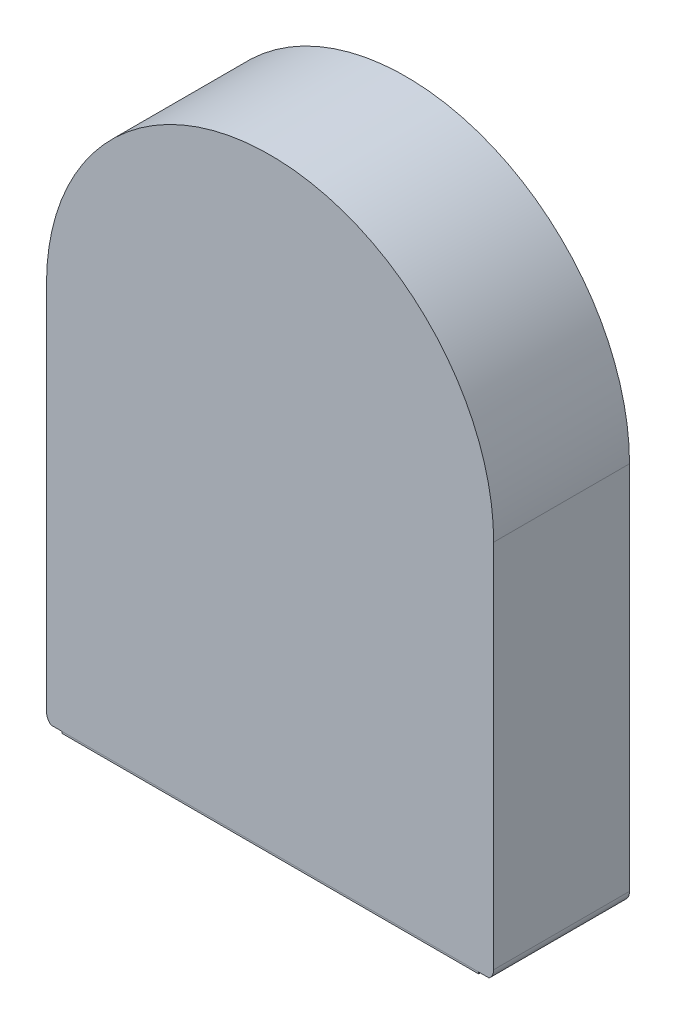
ISO-10303-21;
HEADER;
FILE_DESCRIPTION(('STEP AP214'),'2;1');
FILE_NAME('part.step','',(''),(''),'','','');
FILE_SCHEMA(('AUTOMOTIVE_DESIGN { 1 0 10303 214 1 1 1 1 }'));
ENDSEC;
DATA;
#1=APPLICATION_CONTEXT('core data for automotive mechanical design processes');
#2=APPLICATION_PROTOCOL_DEFINITION('international standard','automotive_design',2000,#1);
#3=PRODUCT_CONTEXT('',#1,'mechanical');
#4=PRODUCT('Part','Part','',(#3));
#5=PRODUCT_RELATED_PRODUCT_CATEGORY('part','',(#4));
#6=PRODUCT_DEFINITION_FORMATION('','',#4);
#7=PRODUCT_DEFINITION_CONTEXT('part definition',#1,'design');
#8=PRODUCT_DEFINITION('design','',#6,#7);
#9=PRODUCT_DEFINITION_SHAPE('','',#8);
#10=(LENGTH_UNIT() NAMED_UNIT(*) SI_UNIT(.MILLI.,.METRE.));
#11=(NAMED_UNIT(*) PLANE_ANGLE_UNIT() SI_UNIT($,.RADIAN.));
#12=(NAMED_UNIT(*) SI_UNIT($,.STERADIAN.) SOLID_ANGLE_UNIT());
#13=UNCERTAINTY_MEASURE_WITH_UNIT(LENGTH_MEASURE(1.E-05),#10,'distance_accuracy_value','');
#14=(GEOMETRIC_REPRESENTATION_CONTEXT(3) GLOBAL_UNCERTAINTY_ASSIGNED_CONTEXT((#13)) GLOBAL_UNIT_ASSIGNED_CONTEXT((#10,
#11,#12)) REPRESENTATION_CONTEXT('',''));
#15=CARTESIAN_POINT('',(0.,0.,0.));
#16=DIRECTION('',(0.,0.,1.));
#17=DIRECTION('',(1.,0.,0.));
#18=AXIS2_PLACEMENT_3D('',#15,#16,#17);
#19=CARTESIAN_POINT('',(8.8,-15.4,5.65));
#20=DIRECTION('',(0.,0.,-1.));
#21=DIRECTION('',(-1.,0.,0.));
#22=AXIS2_PLACEMENT_3D('',#19,#20,#21);
#23=CYLINDRICAL_SURFACE('',#22,0.5);
#24=CARTESIAN_POINT('',(8.8,-15.4,6.03039935251033));
#25=DIRECTION('',(0.,0.713250449154018,-0.700909264300018));
#26=DIRECTION('',(0.,0.700909264300018,0.713250449154018));
#27=AXIS2_PLACEMENT_3D('',#24,#25,#26);
#28=ELLIPSE('',#27,0.713359097199747,0.5);
#29=CARTESIAN_POINT('',(9.10934525688194,-15.79281740293,5.63066545920087));
#30=VERTEX_POINT('',#29);
#31=CARTESIAN_POINT('',(8.8,-15.9,5.52159565602451));
#32=VERTEX_POINT('',#31);
#33=EDGE_CURVE('E55',#30,#32,#28,.T.);
#34=ORIENTED_EDGE('',*,*,#33,.T.);
#35=DIRECTION('',(0.,0.,-1.));
#36=VECTOR('',#35,1.);
#37=CARTESIAN_POINT('',(8.8,-15.9,5.65));
#38=LINE('',#37,#36);
#39=CARTESIAN_POINT('',(8.8,-15.9,0.));
#40=VERTEX_POINT('',#39);
#41=EDGE_CURVE('E257',#40,#32,#38,.F.);
#42=ORIENTED_EDGE('',*,*,#41,.F.);
#43=CARTESIAN_POINT('',(8.8,-15.4,0.));
#44=DIRECTION('',(0.,0.,1.));
#45=DIRECTION('',(1.,0.,0.));
#46=AXIS2_PLACEMENT_3D('',#43,#44,#45);
#47=CIRCLE('',#46,0.5);
#48=CARTESIAN_POINT('',(9.3,-15.4,0.));
#49=VERTEX_POINT('',#48);
#50=EDGE_CURVE('E261',#49,#40,#47,.F.);
#51=ORIENTED_EDGE('',*,*,#50,.F.);
#52=DIRECTION('',(0.,0.,-1.));
#53=VECTOR('',#52,1.);
#54=CARTESIAN_POINT('',(9.3,-15.4,5.65));
#55=LINE('',#54,#53);
#56=CARTESIAN_POINT('',(9.3,-15.4,5.65));
#57=VERTEX_POINT('',#56);
#58=EDGE_CURVE('E265',#57,#49,#55,.T.);
#59=ORIENTED_EDGE('',*,*,#58,.F.);
#60=CARTESIAN_POINT('',(8.8,-15.4,5.65));
#61=DIRECTION('',(0.,0.,1.));
#62=DIRECTION('',(1.,0.,0.));
#63=AXIS2_PLACEMENT_3D('',#60,#61,#62);
#64=CIRCLE('',#63,0.5);
#65=CARTESIAN_POINT('',(9.10934525688194,-15.79281740293,5.65));
#66=VERTEX_POINT('',#65);
#67=EDGE_CURVE('E252',#66,#57,#64,.T.);
#68=ORIENTED_EDGE('',*,*,#67,.F.);
#69=DIRECTION('',(0.,0.,-1.));
#70=VECTOR('',#69,1.);
#71=CARTESIAN_POINT('',(9.10934525730095,-15.7928174026,5.65));
#72=LINE('',#71,#70);
#73=EDGE_CURVE('E48',#30,#66,#72,.F.);
#74=ORIENTED_EDGE('',*,*,#73,.F.);
#75=EDGE_LOOP('',(#34,#42,#51,#59,#68,#74));
#76=FACE_BOUND('',#75,.T.);
#77=ADVANCED_FACE('F38',(#76),#23,.T.);
#78=CARTESIAN_POINT('',(-8.8,-15.4,5.65));
#79=DIRECTION('',(0.,0.,-1.));
#80=DIRECTION('',(-1.,0.,0.));
#81=AXIS2_PLACEMENT_3D('',#78,#79,#80);
#82=CYLINDRICAL_SURFACE('',#81,0.5);
#83=CARTESIAN_POINT('',(-8.8,-15.4,5.65));
#84=DIRECTION('',(0.,0.,1.));
#85=DIRECTION('',(1.,0.,0.));
#86=AXIS2_PLACEMENT_3D('',#83,#84,#85);
#87=CIRCLE('',#86,0.5);
#88=CARTESIAN_POINT('',(-9.3,-15.4,5.65));
#89=VERTEX_POINT('',#88);
#90=CARTESIAN_POINT('',(-9.10934525730095,-15.7928174026,5.65));
#91=VERTEX_POINT('',#90);
#92=EDGE_CURVE('E254',#89,#91,#87,.T.);
#93=ORIENTED_EDGE('',*,*,#92,.F.);
#94=DIRECTION('',(0.,0.,-1.));
#95=VECTOR('',#94,1.);
#96=CARTESIAN_POINT('',(-9.3,-15.4,5.65));
#97=LINE('',#96,#95);
#98=CARTESIAN_POINT('',(-9.3,-15.4,0.));
#99=VERTEX_POINT('',#98);
#100=EDGE_CURVE('E250',#99,#89,#97,.F.);
#101=ORIENTED_EDGE('',*,*,#100,.F.);
#102=CARTESIAN_POINT('',(-8.8,-15.4,0.));
#103=DIRECTION('',(0.,0.,1.));
#104=DIRECTION('',(1.,0.,0.));
#105=AXIS2_PLACEMENT_3D('',#102,#103,#104);
#106=CIRCLE('',#105,0.5);
#107=CARTESIAN_POINT('',(-8.8,-15.9,0.));
#108=VERTEX_POINT('',#107);
#109=EDGE_CURVE('E263',#108,#99,#106,.F.);
#110=ORIENTED_EDGE('',*,*,#109,.F.);
#111=DIRECTION('',(0.,0.,-1.));
#112=VECTOR('',#111,1.);
#113=CARTESIAN_POINT('',(-8.8,-15.9,5.65));
#114=LINE('',#113,#112);
#115=CARTESIAN_POINT('',(-8.8,-15.9,5.52159565602451));
#116=VERTEX_POINT('',#115);
#117=EDGE_CURVE('E259',#116,#108,#114,.T.);
#118=ORIENTED_EDGE('',*,*,#117,.F.);
#119=CARTESIAN_POINT('',(-8.8,-15.4,6.03039935251033));
#120=DIRECTION('',(0.,0.713250449154018,-0.700909264300018));
#121=DIRECTION('',(0.,0.700909264300018,0.713250449154018));
#122=AXIS2_PLACEMENT_3D('',#119,#120,#121);
#123=ELLIPSE('',#122,0.713359097199747,0.5);
#124=CARTESIAN_POINT('',(-9.10934525730095,-15.7928174026,5.63066545953665));
#125=VERTEX_POINT('',#124);
#126=EDGE_CURVE('E145',#116,#125,#123,.T.);
#127=ORIENTED_EDGE('',*,*,#126,.T.);
#128=DIRECTION('',(0.,0.,1.));
#129=VECTOR('',#128,1.);
#130=CARTESIAN_POINT('',(-9.10934525730095,-15.7928174026,5.63066545953665));
#131=LINE('',#130,#129);
#132=EDGE_CURVE('E195',#125,#91,#131,.T.);
#133=ORIENTED_EDGE('',*,*,#132,.T.);
#134=EDGE_LOOP('',(#93,#101,#110,#118,#127,#133));
#135=FACE_BOUND('',#134,.T.);
#136=ADVANCED_FACE('F40',(#135),#82,.T.);
#137=CARTESIAN_POINT('',(0.,0.,5.65));
#138=DIRECTION('',(0.,0.,-1.));
#139=DIRECTION('',(-1.,0.,0.));
#140=AXIS2_PLACEMENT_3D('',#137,#138,#139);
#141=CYLINDRICAL_SURFACE('',#140,9.3);
#142=CARTESIAN_POINT('',(0.,0.,0.));
#143=DIRECTION('',(0.,0.,1.));
#144=DIRECTION('',(1.,0.,0.));
#145=AXIS2_PLACEMENT_3D('',#142,#143,#144);
#146=CIRCLE('',#145,9.3);
#147=CARTESIAN_POINT('',(9.3,0.,0.));
#148=VERTEX_POINT('',#147);
#149=CARTESIAN_POINT('',(-9.3,0.,0.));
#150=VERTEX_POINT('',#149);
#151=EDGE_CURVE('E200',#148,#150,#146,.T.);
#152=ORIENTED_EDGE('',*,*,#151,.T.);
#153=DIRECTION('',(0.,0.,-1.));
#154=VECTOR('',#153,1.);
#155=CARTESIAN_POINT('',(-9.3,0.,5.65));
#156=LINE('',#155,#154);
#157=CARTESIAN_POINT('',(-9.3,0.,5.65));
#158=VERTEX_POINT('',#157);
#159=EDGE_CURVE('E267',#158,#150,#156,.T.);
#160=ORIENTED_EDGE('',*,*,#159,.F.);
#161=CARTESIAN_POINT('',(0.,0.,5.65));
#162=DIRECTION('',(0.,0.,1.));
#163=DIRECTION('',(1.,0.,0.));
#164=AXIS2_PLACEMENT_3D('',#161,#162,#163);
#165=CIRCLE('',#164,9.3);
#166=CARTESIAN_POINT('',(9.3,0.,5.65));
#167=VERTEX_POINT('',#166);
#168=EDGE_CURVE('E244',#167,#158,#165,.T.);
#169=ORIENTED_EDGE('',*,*,#168,.F.);
#170=DIRECTION('',(0.,0.,-1.));
#171=VECTOR('',#170,1.);
#172=CARTESIAN_POINT('',(9.3,0.,5.65));
#173=LINE('',#172,#171);
#174=EDGE_CURVE('E269',#167,#148,#173,.T.);
#175=ORIENTED_EDGE('',*,*,#174,.T.);
#176=EDGE_LOOP('',(#152,#160,#169,#175));
#177=FACE_BOUND('',#176,.T.);
#178=ADVANCED_FACE('F357',(#177),#141,.T.);
#179=CARTESIAN_POINT('',(-9.3,0.,5.65));
#180=DIRECTION('',(1.,0.,0.));
#181=DIRECTION('',(0.,1.,0.));
#182=AXIS2_PLACEMENT_3D('',#179,#180,#181);
#183=PLANE('',#182);
#184=ORIENTED_EDGE('',*,*,#159,.T.);
#185=DIRECTION('',(0.,-1.,0.));
#186=VECTOR('',#185,1.);
#187=CARTESIAN_POINT('',(-9.3,0.,0.));
#188=LINE('',#187,#186);
#189=EDGE_CURVE('E277',#150,#99,#188,.T.);
#190=ORIENTED_EDGE('',*,*,#189,.T.);
#191=ORIENTED_EDGE('',*,*,#100,.T.);
#192=DIRECTION('',(0.,-1.,0.));
#193=VECTOR('',#192,1.);
#194=CARTESIAN_POINT('',(-9.3,0.,5.65));
#195=LINE('',#194,#193);
#196=EDGE_CURVE('E241',#158,#89,#195,.T.);
#197=ORIENTED_EDGE('',*,*,#196,.F.);
#198=EDGE_LOOP('',(#184,#190,#191,#197));
#199=FACE_BOUND('',#198,.T.);
#200=ADVANCED_FACE('F358',(#199),#183,.F.);
#201=CARTESIAN_POINT('',(-9.3,-15.9,5.65));
#202=DIRECTION('',(0.,1.,0.));
#203=DIRECTION('',(0.,0.,1.));
#204=AXIS2_PLACEMENT_3D('',#201,#202,#203);
#205=PLANE('',#204);
#206=ORIENTED_EDGE('',*,*,#41,.T.);
#207=DIRECTION('',(-1.,0.,0.));
#208=VECTOR('',#207,1.);
#209=CARTESIAN_POINT('',(0.,-15.9,5.52159565602451));
#210=LINE('',#209,#208);
#211=EDGE_CURVE('E337',#32,#116,#210,.T.);
#212=ORIENTED_EDGE('',*,*,#211,.T.);
#213=ORIENTED_EDGE('',*,*,#117,.T.);
#214=DIRECTION('',(1.,0.,0.));
#215=VECTOR('',#214,1.);
#216=CARTESIAN_POINT('',(-9.3,-15.9,0.));
#217=LINE('',#216,#215);
#218=EDGE_CURVE('E274',#108,#40,#217,.T.);
#219=ORIENTED_EDGE('',*,*,#218,.T.);
#220=EDGE_LOOP('',(#206,#212,#213,#219));
#221=FACE_BOUND('',#220,.T.);
#222=ADVANCED_FACE('F343',(#221),#205,.F.);
#223=CARTESIAN_POINT('',(9.3,0.,5.65));
#224=DIRECTION('',(-1.,0.,0.));
#225=DIRECTION('',(0.,-1.,0.));
#226=AXIS2_PLACEMENT_3D('',#223,#224,#225);
#227=PLANE('',#226);
#228=ORIENTED_EDGE('',*,*,#58,.T.);
#229=DIRECTION('',(0.,1.,0.));
#230=VECTOR('',#229,1.);
#231=CARTESIAN_POINT('',(9.3,0.,0.));
#232=LINE('',#231,#230);
#233=EDGE_CURVE('E247',#49,#148,#232,.T.);
#234=ORIENTED_EDGE('',*,*,#233,.T.);
#235=ORIENTED_EDGE('',*,*,#174,.F.);
#236=DIRECTION('',(0.,1.,0.));
#237=VECTOR('',#236,1.);
#238=CARTESIAN_POINT('',(9.3,0.,5.65));
#239=LINE('',#238,#237);
#240=EDGE_CURVE('E271',#57,#167,#239,.T.);
#241=ORIENTED_EDGE('',*,*,#240,.F.);
#242=EDGE_LOOP('',(#228,#234,#235,#241));
#243=FACE_BOUND('',#242,.T.);
#244=ADVANCED_FACE('F354',(#243),#227,.F.);
#245=CARTESIAN_POINT('',(0.,0.,5.65));
#246=DIRECTION('',(0.,0.,1.));
#247=DIRECTION('',(1.,0.,0.));
#248=AXIS2_PLACEMENT_3D('',#245,#246,#247);
#249=PLANE('',#248);
#250=DIRECTION('',(1.,0.,0.));
#251=VECTOR('',#250,1.);
#252=CARTESIAN_POINT('',(-5.00000000075,-15.7926514013,5.64999710245));
#253=LINE('',#252,#251);
#254=CARTESIAN_POINT('',(-6.97971042440521,-15.7927344019421,5.64999855122482));
#255=VERTEX_POINT('',#254);
#256=CARTESIAN_POINT('',(2.97381740255382,-15.7926513759911,5.64999855122139));
#257=VERTEX_POINT('',#256);
#258=EDGE_CURVE('E176',#255,#257,#253,.T.);
#259=ORIENTED_EDGE('',*,*,#258,.T.);
#260=DIRECTION('',(0.999999999999744,1.24820653344968E-08,7.15097058320817E-07));
#261=VECTOR('',#260,1.);
#262=CARTESIAN_POINT('',(4.99999999925,-15.792651376,5.64999855136));
#263=LINE('',#262,#261);
#264=CARTESIAN_POINT('',(6.97971041935568,-15.7927343769389,5.64999998352249));
#265=VERTEX_POINT('',#264);
#266=EDGE_CURVE('E179',#257,#265,#263,.T.);
#267=ORIENTED_EDGE('',*,*,#266,.T.);
#268=DIRECTION('',(-1.,0.,0.));
#269=VECTOR('',#268,1.);
#270=CARTESIAN_POINT('',(0.,-15.7928174026,5.65));
#271=LINE('',#270,#269);
#272=EDGE_CURVE('E198',#66,#265,#271,.T.);
#273=ORIENTED_EDGE('',*,*,#272,.F.);
#274=ORIENTED_EDGE('',*,*,#67,.T.);
#275=ORIENTED_EDGE('',*,*,#240,.T.);
#276=ORIENTED_EDGE('',*,*,#168,.T.);
#277=ORIENTED_EDGE('',*,*,#196,.T.);
#278=ORIENTED_EDGE('',*,*,#92,.T.);
#279=DIRECTION('',(-1.,0.,0.));
#280=VECTOR('',#279,1.);
#281=CARTESIAN_POINT('',(0.,-15.7928174026,5.65));
#282=LINE('',#281,#280);
#283=EDGE_CURVE('E11',#255,#91,#282,.T.);
#284=ORIENTED_EDGE('',*,*,#283,.F.);
#285=EDGE_LOOP('',(#259,#267,#273,#274,#275,#276,#277,#278,#284));
#286=FACE_BOUND('',#285,.T.);
#287=ADVANCED_FACE('F287',(#286),#249,.T.);
#288=CARTESIAN_POINT('',(0.,0.,0.));
#289=DIRECTION('',(0.,0.,1.));
#290=DIRECTION('',(1.,0.,0.));
#291=AXIS2_PLACEMENT_3D('',#288,#289,#290);
#292=PLANE('',#291);
#293=ORIENTED_EDGE('',*,*,#233,.F.);
#294=ORIENTED_EDGE('',*,*,#50,.T.);
#295=ORIENTED_EDGE('',*,*,#218,.F.);
#296=ORIENTED_EDGE('',*,*,#109,.T.);
#297=ORIENTED_EDGE('',*,*,#189,.F.);
#298=ORIENTED_EDGE('',*,*,#151,.F.);
#299=EDGE_LOOP('',(#293,#294,#295,#296,#297,#298));
#300=FACE_BOUND('',#299,.T.);
#301=ADVANCED_FACE('F220',(#300),#292,.F.);
#302=CARTESIAN_POINT('',(-10.,-15.7928174026,7.15));
#303=DIRECTION('',(0.,1.,0.));
#304=DIRECTION('',(0.,0.,1.));
#305=AXIS2_PLACEMENT_3D('',#302,#303,#304);
#306=PLANE('',#305);
#307=ORIENTED_EDGE('',*,*,#272,.T.);
#308=CARTESIAN_POINT('',(6.97975192830906,-15.7928174026,5.64048689252252));
#309=DIRECTION('',(-0.00436264473487639,0.0174522403538263,0.999838180225955));
#310=VECTOR('',#309,1.);
#311=LINE('',#308,#310);
#312=CARTESIAN_POINT('',(6.97975192830905,-15.7928174026,5.64048689252252));
#313=VERTEX_POINT('',#312);
#314=EDGE_CURVE('E187',#313,#265,#311,.T.);
#315=ORIENTED_EDGE('',*,*,#314,.F.);
#316=DIRECTION('',(1.,0.,0.));
#317=VECTOR('',#316,1.);
#318=CARTESIAN_POINT('',(-8.66700053469144,-15.7928174026,5.64048689252252));
#319=LINE('',#318,#317);
#320=CARTESIAN_POINT('',(8.66820089689577,-15.7928174026,5.64048689252252));
#321=VERTEX_POINT('',#320);
#322=EDGE_CURVE('E160',#313,#321,#319,.T.);
#323=ORIENTED_EDGE('',*,*,#322,.T.);
#324=DIRECTION('',(0.,0.,-1.));
#325=VECTOR('',#324,1.);
#326=CARTESIAN_POINT('',(8.66820089689577,-15.7928174026,0.999999999999998));
#327=LINE('',#326,#325);
#328=CARTESIAN_POINT('',(8.66821322781486,-15.7928174036935,5.63066545842397));
#329=VERTEX_POINT('',#328);
#330=EDGE_CURVE('E152',#321,#329,#327,.T.);
#331=ORIENTED_EDGE('',*,*,#330,.T.);
#332=DIRECTION('',(-1.,-1.73074002985439E-09,-1.7612138496918E-09));
#333=VECTOR('',#332,1.);
#334=CARTESIAN_POINT('',(-4.9999999983754,-15.7928174273496,5.6306654343513));
#335=LINE('',#334,#333);
#336=EDGE_CURVE('E136',#30,#329,#335,.T.);
#337=ORIENTED_EDGE('',*,*,#336,.F.);
#338=ORIENTED_EDGE('',*,*,#73,.T.);
#339=EDGE_LOOP('',(#307,#315,#323,#331,#337,#338));
#340=FACE_BOUND('',#339,.T.);
#341=ADVANCED_FACE('F157',(#340),#306,.F.);
#342=CARTESIAN_POINT('',(8.27396970801,-15.8738174032,0.999999999999998));
#343=DIRECTION('',(0.,-1.,0.));
#344=DIRECTION('',(0.,0.,-1.));
#345=AXIS2_PLACEMENT_3D('',#342,#343,#344);
#346=PLANE('',#345);
#347=DIRECTION('',(1.,0.,0.));
#348=VECTOR('',#347,1.);
#349=CARTESIAN_POINT('',(8.27396970801,-15.8738174032,5.54823926009538));
#350=LINE('',#349,#348);
#351=CARTESIAN_POINT('',(-8.66700053469144,-15.8738174032,5.54823926009538));
#352=VERTEX_POINT('',#351);
#353=CARTESIAN_POINT('',(8.66820089689577,-15.8738174032,5.54823926009538));
#354=VERTEX_POINT('',#353);
#355=EDGE_CURVE('E155',#352,#354,#350,.T.);
#356=ORIENTED_EDGE('',*,*,#355,.T.);
#357=DIRECTION('',(0.,0.,-1.));
#358=VECTOR('',#357,1.);
#359=CARTESIAN_POINT('',(8.66820089689577,-15.8738174032,0.999999999999998));
#360=LINE('',#359,#358);
#361=CARTESIAN_POINT('',(8.66820089689577,-15.8738174032,5.64048689252252));
#362=VERTEX_POINT('',#361);
#363=EDGE_CURVE('E153',#362,#354,#360,.T.);
#364=ORIENTED_EDGE('',*,*,#363,.F.);
#365=DIRECTION('',(1.,0.,0.));
#366=VECTOR('',#365,1.);
#367=CARTESIAN_POINT('',(-8.66700053469144,-15.8738174032,5.64048689252252));
#368=LINE('',#367,#366);
#369=CARTESIAN_POINT('',(-8.66700053469144,-15.8738174032,5.64048689252252));
#370=VERTEX_POINT('',#369);
#371=EDGE_CURVE('E162',#370,#362,#368,.T.);
#372=ORIENTED_EDGE('',*,*,#371,.F.);
#373=DIRECTION('',(0.,0.,1.));
#374=VECTOR('',#373,1.);
#375=CARTESIAN_POINT('',(-8.66700053469144,-15.8738174032,0.999999999999998));
#376=LINE('',#375,#374);
#377=EDGE_CURVE('E321',#352,#370,#376,.T.);
#378=ORIENTED_EDGE('',*,*,#377,.F.);
#379=EDGE_LOOP('',(#356,#364,#372,#378));
#380=FACE_BOUND('',#379,.T.);
#381=ADVANCED_FACE('F219',(#380),#346,.T.);
#382=ORIENTED_EDGE('',*,*,#283,.T.);
#383=ORIENTED_EDGE('',*,*,#132,.F.);
#384=DIRECTION('',(-1.,0.,0.));
#385=VECTOR('',#384,1.);
#386=CARTESIAN_POINT('',(-10.,-15.7928174026,5.63066545953665));
#387=LINE('',#386,#385);
#388=CARTESIAN_POINT('',(-8.66700053469144,-15.7928174026,5.63066545953665));
#389=VERTEX_POINT('',#388);
#390=EDGE_CURVE('E297',#389,#125,#387,.T.);
#391=ORIENTED_EDGE('',*,*,#390,.F.);
#392=DIRECTION('',(0.,0.,1.));
#393=VECTOR('',#392,1.);
#394=CARTESIAN_POINT('',(-8.66700053469144,-15.7928174026,0.999999999999998));
#395=LINE('',#394,#393);
#396=CARTESIAN_POINT('',(-8.66700053469144,-15.7928174026,5.64048689252252));
#397=VERTEX_POINT('',#396);
#398=EDGE_CURVE('E154',#389,#397,#395,.T.);
#399=ORIENTED_EDGE('',*,*,#398,.T.);
#400=CARTESIAN_POINT('',(-6.97975192710905,-15.7928174026,5.64048689252252));
#401=VERTEX_POINT('',#400);
#402=EDGE_CURVE('E163',#397,#401,#319,.T.);
#403=ORIENTED_EDGE('',*,*,#402,.T.);
#404=CARTESIAN_POINT('',(-6.97971043072667,-15.7926514012683,5.64999710244945));
#405=DIRECTION('',(-0.00436264475399805,-0.0174522403537114,-0.999838180225874));
#406=VECTOR('',#405,1.);
#407=LINE('',#404,#406);
#408=EDGE_CURVE('E203',#255,#401,#407,.T.);
#409=ORIENTED_EDGE('',*,*,#408,.F.);
#410=EDGE_LOOP('',(#382,#383,#391,#399,#403,#409));
#411=FACE_BOUND('',#410,.T.);
#412=ADVANCED_FACE('F221',(#411),#306,.F.);
#413=CARTESIAN_POINT('',(8.66820089689577,-33.8193830747908,0.999999999999998));
#414=DIRECTION('',(1.,0.,0.));
#415=DIRECTION('',(0.,0.,-1.));
#416=AXIS2_PLACEMENT_3D('',#413,#414,#415);
#417=PLANE('',#416);
#418=DIRECTION('',(0.,0.700909264300018,0.713250449154018));
#419=VECTOR('',#418,1.);
#420=CARTESIAN_POINT('',(8.66820089689578,-26.9637768566889,-5.73698546753076));
#421=LINE('',#420,#419);
#422=EDGE_CURVE('E140',#354,#329,#421,.T.);
#423=ORIENTED_EDGE('',*,*,#422,.T.);
#424=ORIENTED_EDGE('',*,*,#330,.F.);
#425=DIRECTION('',(0.,1.,0.));
#426=VECTOR('',#425,1.);
#427=CARTESIAN_POINT('',(8.66820089689577,-33.8193830747908,5.64048689252252));
#428=LINE('',#427,#426);
#429=EDGE_CURVE('E166',#362,#321,#428,.T.);
#430=ORIENTED_EDGE('',*,*,#429,.F.);
#431=ORIENTED_EDGE('',*,*,#363,.T.);
#432=EDGE_LOOP('',(#423,#424,#430,#431));
#433=FACE_BOUND('',#432,.T.);
#434=ADVANCED_FACE('F150',(#433),#417,.T.);
#435=CARTESIAN_POINT('',(-8.66700053469144,-33.8193830747908,0.999999999999998));
#436=DIRECTION('',(-1.,0.,0.));
#437=DIRECTION('',(0.,0.,1.));
#438=AXIS2_PLACEMENT_3D('',#435,#436,#437);
#439=PLANE('',#438);
#440=DIRECTION('',(0.,-0.700909264300018,-0.713250449154018));
#441=VECTOR('',#440,1.);
#442=CARTESIAN_POINT('',(-8.66700053469144,-26.9637768566889,-5.73698546753076));
#443=LINE('',#442,#441);
#444=EDGE_CURVE('E146',#389,#352,#443,.T.);
#445=ORIENTED_EDGE('',*,*,#444,.T.);
#446=ORIENTED_EDGE('',*,*,#377,.T.);
#447=DIRECTION('',(0.,1.,0.));
#448=VECTOR('',#447,1.);
#449=CARTESIAN_POINT('',(-8.66700053469144,-33.8193830747908,5.64048689252252));
#450=LINE('',#449,#448);
#451=EDGE_CURVE('E323',#370,#397,#450,.T.);
#452=ORIENTED_EDGE('',*,*,#451,.T.);
#453=ORIENTED_EDGE('',*,*,#398,.F.);
#454=EDGE_LOOP('',(#445,#446,#452,#453));
#455=FACE_BOUND('',#454,.T.);
#456=ADVANCED_FACE('F443',(#455),#439,.T.);
#457=CARTESIAN_POINT('',(9.3,-15.9,-0.500000000000002));
#458=DIRECTION('',(0.,-0.999847695156391,0.0174524064373068));
#459=DIRECTION('',(-1.,0.,0.));
#460=AXIS2_PLACEMENT_3D('',#457,#458,#459);
#461=PLANE('',#460);
#462=ORIENTED_EDGE('',*,*,#314,.T.);
#463=ORIENTED_EDGE('',*,*,#266,.F.);
#464=ORIENTED_EDGE('',*,*,#258,.F.);
#465=ORIENTED_EDGE('',*,*,#408,.T.);
#466=DIRECTION('',(-1.,0.,0.));
#467=VECTOR('',#466,1.);
#468=CARTESIAN_POINT('',(9.3,-15.7928174026,5.64048689252304));
#469=LINE('',#468,#467);
#470=EDGE_CURVE('E180',#313,#401,#469,.T.);
#471=ORIENTED_EDGE('',*,*,#470,.F.);
#472=EDGE_LOOP('',(#462,#463,#464,#465,#471));
#473=FACE_BOUND('',#472,.T.);
#474=ADVANCED_FACE('F224',(#473),#461,.T.);
#475=CARTESIAN_POINT('',(-8.66700053469144,-33.8193830747908,5.64048689252252));
#476=DIRECTION('',(0.,0.,1.));
#477=DIRECTION('',(1.,0.,0.));
#478=AXIS2_PLACEMENT_3D('',#475,#476,#477);
#479=PLANE('',#478);
#480=ORIENTED_EDGE('',*,*,#451,.F.);
#481=ORIENTED_EDGE('',*,*,#371,.T.);
#482=ORIENTED_EDGE('',*,*,#429,.T.);
#483=ORIENTED_EDGE('',*,*,#322,.F.);
#484=ORIENTED_EDGE('',*,*,#470,.T.);
#485=ORIENTED_EDGE('',*,*,#402,.F.);
#486=EDGE_LOOP('',(#480,#481,#482,#483,#484,#485));
#487=FACE_BOUND('',#486,.T.);
#488=ADVANCED_FACE('F222',(#487),#479,.T.);
#489=CARTESIAN_POINT('',(-5.,-15.3316709855,6.09993146282));
#490=DIRECTION('',(0.,0.713250449154018,-0.700909264300018));
#491=DIRECTION('',(-1.,0.,0.));
#492=AXIS2_PLACEMENT_3D('',#489,#490,#491);
#493=PLANE('',#492);
#494=ORIENTED_EDGE('',*,*,#336,.T.);
#495=ORIENTED_EDGE('',*,*,#422,.F.);
#496=ORIENTED_EDGE('',*,*,#355,.F.);
#497=ORIENTED_EDGE('',*,*,#444,.F.);
#498=ORIENTED_EDGE('',*,*,#390,.T.);
#499=ORIENTED_EDGE('',*,*,#126,.F.);
#500=ORIENTED_EDGE('',*,*,#211,.F.);
#501=ORIENTED_EDGE('',*,*,#33,.F.);
#502=EDGE_LOOP('',(#494,#495,#496,#497,#498,#499,#500,#501));
#503=FACE_BOUND('',#502,.T.);
#504=ADVANCED_FACE('F138',(#503),#493,.F.);
#505=CLOSED_SHELL('',(#77,#136,#178,#200,#222,#244,#287,#301,#341,#381,#412,#434,#456,#474,#488,#504));
#506=MANIFOLD_SOLID_BREP('B2',#505);
#507=ADVANCED_BREP_SHAPE_REPRESENTATION('',(#18,#506),#14);
#508=SHAPE_DEFINITION_REPRESENTATION(#9,#507);
ENDSEC;
END-ISO-10303-21;
